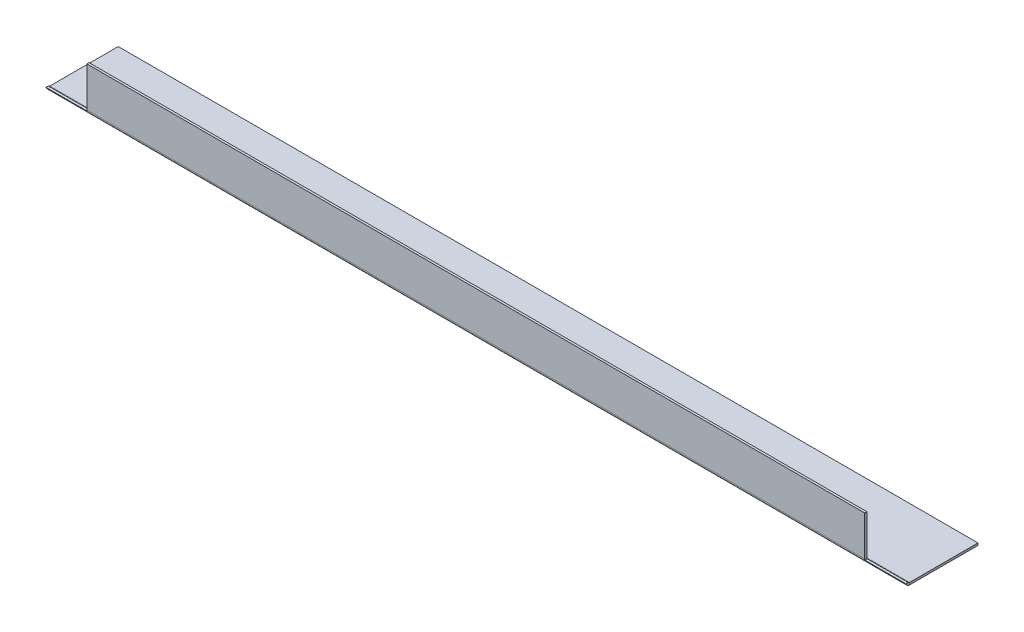
ISO-10303-21;
HEADER;
FILE_DESCRIPTION(('STEP AP214'),'2;1');
FILE_NAME('part.step','',(''),(''),'','','');
FILE_SCHEMA(('AUTOMOTIVE_DESIGN { 1 0 10303 214 1 1 1 1 }'));
ENDSEC;
DATA;
#1=APPLICATION_CONTEXT('core data for automotive mechanical design processes');
#2=APPLICATION_PROTOCOL_DEFINITION('international standard','automotive_design',2000,#1);
#3=PRODUCT_CONTEXT('',#1,'mechanical');
#4=PRODUCT('Part','Part','',(#3));
#5=PRODUCT_RELATED_PRODUCT_CATEGORY('part','',(#4));
#6=PRODUCT_DEFINITION_FORMATION('','',#4);
#7=PRODUCT_DEFINITION_CONTEXT('part definition',#1,'design');
#8=PRODUCT_DEFINITION('design','',#6,#7);
#9=PRODUCT_DEFINITION_SHAPE('','',#8);
#10=(LENGTH_UNIT() NAMED_UNIT(*) SI_UNIT(.MILLI.,.METRE.));
#11=(NAMED_UNIT(*) PLANE_ANGLE_UNIT() SI_UNIT($,.RADIAN.));
#12=(NAMED_UNIT(*) SI_UNIT($,.STERADIAN.) SOLID_ANGLE_UNIT());
#13=UNCERTAINTY_MEASURE_WITH_UNIT(LENGTH_MEASURE(1.E-05),#10,'distance_accuracy_value','');
#14=(GEOMETRIC_REPRESENTATION_CONTEXT(3) GLOBAL_UNCERTAINTY_ASSIGNED_CONTEXT((#13)) GLOBAL_UNIT_ASSIGNED_CONTEXT((#10,
#11,#12)) REPRESENTATION_CONTEXT('',''));
#15=CARTESIAN_POINT('',(0.,0.,0.));
#16=DIRECTION('',(0.,0.,1.));
#17=DIRECTION('',(1.,0.,0.));
#18=AXIS2_PLACEMENT_3D('',#15,#16,#17);
#19=CARTESIAN_POINT('',(0.,3.,93.5));
#20=DIRECTION('',(0.,-1.,0.));
#21=DIRECTION('',(1.,0.,0.));
#22=AXIS2_PLACEMENT_3D('',#19,#20,#21);
#23=PLANE('',#22);
#24=DIRECTION('',(-1.,0.,0.));
#25=VECTOR('',#24,1.);
#26=CARTESIAN_POINT('',(0.,3.,0.));
#27=LINE('',#26,#25);
#28=CARTESIAN_POINT('',(0.,3.,0.));
#29=VERTEX_POINT('',#28);
#30=CARTESIAN_POINT('',(-1176.,2.99999999999986,0.));
#31=VERTEX_POINT('',#30);
#32=EDGE_CURVE('E178',#29,#31,#27,.T.);
#33=ORIENTED_EDGE('',*,*,#32,.T.);
#34=DIRECTION('',(0.,0.,-1.));
#35=VECTOR('',#34,1.);
#36=CARTESIAN_POINT('',(-1176.,2.99999999999986,93.5));
#37=LINE('',#36,#35);
#38=CARTESIAN_POINT('',(-1176.,2.99999999999991,93.5));
#39=VERTEX_POINT('',#38);
#40=EDGE_CURVE('E211',#39,#31,#37,.T.);
#41=ORIENTED_EDGE('',*,*,#40,.F.);
#42=DIRECTION('',(-1.,0.,0.));
#43=VECTOR('',#42,1.);
#44=CARTESIAN_POINT('',(0.,3.,93.5));
#45=LINE('',#44,#43);
#46=CARTESIAN_POINT('',(0.,2.99999999999991,93.5));
#47=VERTEX_POINT('',#46);
#48=EDGE_CURVE('E183',#47,#39,#45,.T.);
#49=ORIENTED_EDGE('',*,*,#48,.F.);
#50=DIRECTION('',(0.,0.,-1.));
#51=VECTOR('',#50,1.);
#52=CARTESIAN_POINT('',(0.,3.,93.5));
#53=LINE('',#52,#51);
#54=EDGE_CURVE('E195',#47,#29,#53,.T.);
#55=ORIENTED_EDGE('',*,*,#54,.T.);
#56=EDGE_LOOP('',(#33,#41,#49,#55));
#57=FACE_BOUND('',#56,.T.);
#58=ADVANCED_FACE('F59',(#57),#23,.F.);
#59=CARTESIAN_POINT('',(-1176.,-1.44018463579729E-13,93.5));
#60=DIRECTION('',(-1.,0.,0.));
#61=DIRECTION('',(0.,0.,1.));
#62=AXIS2_PLACEMENT_3D('',#59,#60,#61);
#63=PLANE('',#62);
#64=DIRECTION('',(0.,1.,0.));
#65=VECTOR('',#64,1.);
#66=CARTESIAN_POINT('',(-1176.,-1.44018463579729E-13,0.));
#67=LINE('',#66,#65);
#68=CARTESIAN_POINT('',(-1176.,-1.44018463579729E-13,0.));
#69=VERTEX_POINT('',#68);
#70=EDGE_CURVE('E198',#69,#31,#67,.T.);
#71=ORIENTED_EDGE('',*,*,#70,.F.);
#72=DIRECTION('',(0.,0.,-1.));
#73=VECTOR('',#72,1.);
#74=CARTESIAN_POINT('',(-1176.,-1.44018463579729E-13,93.5));
#75=LINE('',#74,#73);
#76=CARTESIAN_POINT('',(-1176.,-1.44018463579729E-13,93.5));
#77=VERTEX_POINT('',#76);
#78=EDGE_CURVE('E209',#77,#69,#75,.T.);
#79=ORIENTED_EDGE('',*,*,#78,.F.);
#80=DIRECTION('',(0.,1.,0.));
#81=VECTOR('',#80,1.);
#82=CARTESIAN_POINT('',(-1176.,-1.44018463579729E-13,93.5));
#83=LINE('',#82,#81);
#84=EDGE_CURVE('E185',#77,#39,#83,.T.);
#85=ORIENTED_EDGE('',*,*,#84,.T.);
#86=ORIENTED_EDGE('',*,*,#40,.T.);
#87=EDGE_LOOP('',(#71,#79,#85,#86));
#88=FACE_BOUND('',#87,.T.);
#89=ADVANCED_FACE('F293',(#88),#63,.T.);
#90=CARTESIAN_POINT('',(0.,0.,93.5));
#91=DIRECTION('',(0.,-1.,0.));
#92=DIRECTION('',(1.,0.,0.));
#93=AXIS2_PLACEMENT_3D('',#90,#91,#92);
#94=PLANE('',#93);
#95=DIRECTION('',(-1.,0.,0.));
#96=VECTOR('',#95,1.);
#97=CARTESIAN_POINT('',(0.,0.,0.));
#98=LINE('',#97,#96);
#99=CARTESIAN_POINT('',(0.,0.,0.));
#100=VERTEX_POINT('',#99);
#101=EDGE_CURVE('E201',#100,#69,#98,.T.);
#102=ORIENTED_EDGE('',*,*,#101,.F.);
#103=DIRECTION('',(0.,0.,-1.));
#104=VECTOR('',#103,1.);
#105=CARTESIAN_POINT('',(0.,0.,93.5));
#106=LINE('',#105,#104);
#107=CARTESIAN_POINT('',(0.,0.,93.5));
#108=VERTEX_POINT('',#107);
#109=EDGE_CURVE('E207',#108,#100,#106,.T.);
#110=ORIENTED_EDGE('',*,*,#109,.F.);
#111=DIRECTION('',(-1.,0.,0.));
#112=VECTOR('',#111,1.);
#113=CARTESIAN_POINT('',(0.,0.,93.5));
#114=LINE('',#113,#112);
#115=EDGE_CURVE('E189',#108,#77,#114,.T.);
#116=ORIENTED_EDGE('',*,*,#115,.T.);
#117=ORIENTED_EDGE('',*,*,#78,.T.);
#118=EDGE_LOOP('',(#102,#110,#116,#117));
#119=FACE_BOUND('',#118,.T.);
#120=ADVANCED_FACE('F272',(#119),#94,.T.);
#121=CARTESIAN_POINT('',(0.,3.,93.5));
#122=DIRECTION('',(1.,0.,0.));
#123=DIRECTION('',(0.,1.,0.));
#124=AXIS2_PLACEMENT_3D('',#121,#122,#123);
#125=PLANE('',#124);
#126=DIRECTION('',(0.,-1.,0.));
#127=VECTOR('',#126,1.);
#128=CARTESIAN_POINT('',(0.,3.,0.));
#129=LINE('',#128,#127);
#130=EDGE_CURVE('E186',#29,#100,#129,.T.);
#131=ORIENTED_EDGE('',*,*,#130,.F.);
#132=ORIENTED_EDGE('',*,*,#54,.F.);
#133=DIRECTION('',(0.,-1.,0.));
#134=VECTOR('',#133,1.);
#135=CARTESIAN_POINT('',(0.,3.,93.5));
#136=LINE('',#135,#134);
#137=EDGE_CURVE('E192',#47,#108,#136,.T.);
#138=ORIENTED_EDGE('',*,*,#137,.T.);
#139=ORIENTED_EDGE('',*,*,#109,.T.);
#140=EDGE_LOOP('',(#131,#132,#138,#139));
#141=FACE_BOUND('',#140,.T.);
#142=ADVANCED_FACE('F276',(#141),#125,.T.);
#143=CARTESIAN_POINT('',(0.,0.,0.));
#144=DIRECTION('',(0.,0.,-1.));
#145=DIRECTION('',(-1.,0.,0.));
#146=AXIS2_PLACEMENT_3D('',#143,#144,#145);
#147=PLANE('',#146);
#148=ORIENTED_EDGE('',*,*,#32,.F.);
#149=ORIENTED_EDGE('',*,*,#130,.T.);
#150=ORIENTED_EDGE('',*,*,#101,.T.);
#151=ORIENTED_EDGE('',*,*,#70,.T.);
#152=EDGE_LOOP('',(#148,#149,#150,#151));
#153=FACE_BOUND('',#152,.T.);
#154=ADVANCED_FACE('F306',(#153),#147,.T.);
#155=CARTESIAN_POINT('',(-1176.,5.49999999999989,93.5));
#156=DIRECTION('',(-1.,0.,0.));
#157=DIRECTION('',(0.,0.,1.));
#158=AXIS2_PLACEMENT_3D('',#155,#156,#157);
#159=PLANE('',#158);
#160=DIRECTION('',(0.,0.,1.));
#161=VECTOR('',#160,1.);
#162=CARTESIAN_POINT('',(-1176.,4.00000000000001,89.));
#163=LINE('',#162,#161);
#164=CARTESIAN_POINT('',(-1176.,4.00000000000001,95.5000000000001));
#165=VERTEX_POINT('',#164);
#166=CARTESIAN_POINT('',(-1176.,4.00000000000001,98.7915026221292));
#167=VERTEX_POINT('',#166);
#168=EDGE_CURVE('E226',#165,#167,#163,.T.);
#169=ORIENTED_EDGE('',*,*,#168,.F.);
#170=CARTESIAN_POINT('',(-1176.,5.49999999999989,93.5));
#171=DIRECTION('',(1.,0.,0.));
#172=DIRECTION('',(0.,0.,-1.));
#173=AXIS2_PLACEMENT_3D('',#170,#171,#172);
#174=CIRCLE('',#173,2.49999999999999);
#175=EDGE_CURVE('E164',#39,#165,#174,.F.);
#176=ORIENTED_EDGE('',*,*,#175,.F.);
#177=ORIENTED_EDGE('',*,*,#84,.F.);
#178=CARTESIAN_POINT('',(-1176.,5.49999999999989,93.5));
#179=DIRECTION('',(1.,0.,0.));
#180=DIRECTION('',(0.,0.,-1.));
#181=AXIS2_PLACEMENT_3D('',#178,#179,#180);
#182=CIRCLE('',#181,5.49999999999999);
#183=EDGE_CURVE('E175',#77,#167,#182,.F.);
#184=ORIENTED_EDGE('',*,*,#183,.T.);
#185=EDGE_LOOP('',(#169,#176,#177,#184));
#186=FACE_BOUND('',#185,.T.);
#187=ADVANCED_FACE('F231',(#186),#159,.T.);
#188=CARTESIAN_POINT('',(0.,5.49999999999989,93.5));
#189=DIRECTION('',(-1.,0.,0.));
#190=DIRECTION('',(0.,0.,1.));
#191=AXIS2_PLACEMENT_3D('',#188,#189,#190);
#192=PLANE('',#191);
#193=DIRECTION('',(0.,0.,1.));
#194=VECTOR('',#193,1.);
#195=CARTESIAN_POINT('',(0.,4.,89.));
#196=LINE('',#195,#194);
#197=CARTESIAN_POINT('',(0.,4.,95.5000000000001));
#198=VERTEX_POINT('',#197);
#199=CARTESIAN_POINT('',(0.,4.,98.7915026221292));
#200=VERTEX_POINT('',#199);
#201=EDGE_CURVE('E260',#198,#200,#196,.T.);
#202=ORIENTED_EDGE('',*,*,#201,.T.);
#203=CARTESIAN_POINT('',(0.,5.49999999999989,93.5));
#204=DIRECTION('',(1.,0.,0.));
#205=DIRECTION('',(0.,0.,-1.));
#206=AXIS2_PLACEMENT_3D('',#203,#204,#205);
#207=CIRCLE('',#206,5.49999999999999);
#208=EDGE_CURVE('E179',#200,#108,#207,.T.);
#209=ORIENTED_EDGE('',*,*,#208,.T.);
#210=ORIENTED_EDGE('',*,*,#137,.F.);
#211=CARTESIAN_POINT('',(0.,5.49999999999989,93.5));
#212=DIRECTION('',(1.,0.,0.));
#213=DIRECTION('',(0.,0.,-1.));
#214=AXIS2_PLACEMENT_3D('',#211,#212,#213);
#215=CIRCLE('',#214,2.49999999999999);
#216=EDGE_CURVE('E161',#198,#47,#215,.T.);
#217=ORIENTED_EDGE('',*,*,#216,.F.);
#218=EDGE_LOOP('',(#202,#209,#210,#217));
#219=FACE_BOUND('',#218,.T.);
#220=ADVANCED_FACE('F265',(#219),#192,.F.);
#221=CARTESIAN_POINT('',(0.,5.49999999999989,93.5));
#222=DIRECTION('',(1.,0.,0.));
#223=DIRECTION('',(0.,0.,1.));
#224=AXIS2_PLACEMENT_3D('',#221,#222,#223);
#225=CYLINDRICAL_SURFACE('',#224,5.49999999999999);
#226=DIRECTION('',(1.,0.,0.));
#227=VECTOR('',#226,1.);
#228=CARTESIAN_POINT('',(0.,4.,98.7915026221292));
#229=LINE('',#228,#227);
#230=CARTESIAN_POINT('',(-56.,4.,98.7915026221292));
#231=VERTEX_POINT('',#230);
#232=EDGE_CURVE('E238',#231,#200,#229,.T.);
#233=ORIENTED_EDGE('',*,*,#232,.F.);
#234=CARTESIAN_POINT('',(-56.,5.49999999999989,93.5));
#235=DIRECTION('',(-1.,0.,0.));
#236=DIRECTION('',(0.,0.,1.));
#237=AXIS2_PLACEMENT_3D('',#234,#235,#236);
#238=CIRCLE('',#237,5.49999999999999);
#239=CARTESIAN_POINT('',(-56.,5.49999999999985,99.));
#240=VERTEX_POINT('',#239);
#241=EDGE_CURVE('E250',#240,#231,#238,.F.);
#242=ORIENTED_EDGE('',*,*,#241,.F.);
#243=DIRECTION('',(1.,0.,0.));
#244=VECTOR('',#243,1.);
#245=CARTESIAN_POINT('',(-1176.,5.49999999999984,99.));
#246=LINE('',#245,#244);
#247=CARTESIAN_POINT('',(-1120.,5.49999999999984,99.));
#248=VERTEX_POINT('',#247);
#249=EDGE_CURVE('E154',#240,#248,#246,.F.);
#250=ORIENTED_EDGE('',*,*,#249,.T.);
#251=CARTESIAN_POINT('',(-1120.,5.49999999999989,93.5));
#252=DIRECTION('',(1.,0.,0.));
#253=DIRECTION('',(0.,0.,-1.));
#254=AXIS2_PLACEMENT_3D('',#251,#252,#253);
#255=CIRCLE('',#254,5.49999999999999);
#256=CARTESIAN_POINT('',(-1120.,4.00000000000001,98.7915026221292));
#257=VERTEX_POINT('',#256);
#258=EDGE_CURVE('E242',#257,#248,#255,.F.);
#259=ORIENTED_EDGE('',*,*,#258,.F.);
#260=DIRECTION('',(1.,0.,0.));
#261=VECTOR('',#260,1.);
#262=CARTESIAN_POINT('',(0.,4.00000000000001,98.7915026221292));
#263=LINE('',#262,#261);
#264=EDGE_CURVE('E168',#167,#257,#263,.T.);
#265=ORIENTED_EDGE('',*,*,#264,.F.);
#266=ORIENTED_EDGE('',*,*,#183,.F.);
#267=ORIENTED_EDGE('',*,*,#115,.F.);
#268=ORIENTED_EDGE('',*,*,#208,.F.);
#269=EDGE_LOOP('',(#233,#242,#250,#259,#265,#266,#267,#268));
#270=FACE_BOUND('',#269,.T.);
#271=ADVANCED_FACE('F249',(#270),#225,.T.);
#272=CARTESIAN_POINT('',(0.,5.49999999999989,93.5));
#273=DIRECTION('',(1.,0.,0.));
#274=DIRECTION('',(0.,0.,1.));
#275=AXIS2_PLACEMENT_3D('',#272,#273,#274);
#276=CYLINDRICAL_SURFACE('',#275,2.49999999999999);
#277=CARTESIAN_POINT('',(-56.,5.49999999999989,93.5));
#278=DIRECTION('',(-1.,0.,0.));
#279=DIRECTION('',(0.,0.,1.));
#280=AXIS2_PLACEMENT_3D('',#277,#278,#279);
#281=CIRCLE('',#280,2.49999999999999);
#282=CARTESIAN_POINT('',(-56.,5.49999999999984,96.));
#283=VERTEX_POINT('',#282);
#284=CARTESIAN_POINT('',(-56.,4.,95.5000000000001));
#285=VERTEX_POINT('',#284);
#286=EDGE_CURVE('E254',#283,#285,#281,.F.);
#287=ORIENTED_EDGE('',*,*,#286,.T.);
#288=DIRECTION('',(1.,0.,0.));
#289=VECTOR('',#288,1.);
#290=CARTESIAN_POINT('',(0.,4.,95.5000000000001));
#291=LINE('',#290,#289);
#292=EDGE_CURVE('E13',#285,#198,#291,.T.);
#293=ORIENTED_EDGE('',*,*,#292,.T.);
#294=ORIENTED_EDGE('',*,*,#216,.T.);
#295=ORIENTED_EDGE('',*,*,#48,.T.);
#296=ORIENTED_EDGE('',*,*,#175,.T.);
#297=DIRECTION('',(1.,0.,0.));
#298=VECTOR('',#297,1.);
#299=CARTESIAN_POINT('',(0.,4.00000000000001,95.5000000000001));
#300=LINE('',#299,#298);
#301=CARTESIAN_POINT('',(-1120.,4.00000000000001,95.5000000000001));
#302=VERTEX_POINT('',#301);
#303=EDGE_CURVE('E151',#165,#302,#300,.T.);
#304=ORIENTED_EDGE('',*,*,#303,.T.);
#305=CARTESIAN_POINT('',(-1120.,5.49999999999989,93.5));
#306=DIRECTION('',(1.,0.,0.));
#307=DIRECTION('',(0.,0.,-1.));
#308=AXIS2_PLACEMENT_3D('',#305,#306,#307);
#309=CIRCLE('',#308,2.49999999999999);
#310=CARTESIAN_POINT('',(-1120.,5.49999999999984,96.));
#311=VERTEX_POINT('',#310);
#312=EDGE_CURVE('E219',#302,#311,#309,.F.);
#313=ORIENTED_EDGE('',*,*,#312,.T.);
#314=DIRECTION('',(1.,0.,0.));
#315=VECTOR('',#314,1.);
#316=CARTESIAN_POINT('',(-1176.,5.49999999999984,96.));
#317=LINE('',#316,#315);
#318=EDGE_CURVE('E172',#311,#283,#317,.T.);
#319=ORIENTED_EDGE('',*,*,#318,.T.);
#320=EDGE_LOOP('',(#287,#293,#294,#295,#296,#304,#313,#319));
#321=FACE_BOUND('',#320,.T.);
#322=ADVANCED_FACE('F218',(#321),#276,.F.);
#323=CARTESIAN_POINT('',(0.,0.,99.));
#324=DIRECTION('',(0.,0.,-1.));
#325=DIRECTION('',(-1.,0.,0.));
#326=AXIS2_PLACEMENT_3D('',#323,#324,#325);
#327=PLANE('',#326);
#328=ORIENTED_EDGE('',*,*,#249,.F.);
#329=DIRECTION('',(0.,-1.,0.));
#330=VECTOR('',#329,1.);
#331=CARTESIAN_POINT('',(-56.,60.,99.));
#332=LINE('',#331,#330);
#333=CARTESIAN_POINT('',(-56.,60.,99.));
#334=VERTEX_POINT('',#333);
#335=EDGE_CURVE('E147',#334,#240,#332,.T.);
#336=ORIENTED_EDGE('',*,*,#335,.F.);
#337=DIRECTION('',(-1.,0.,0.));
#338=VECTOR('',#337,1.);
#339=CARTESIAN_POINT('',(0.,60.,99.));
#340=LINE('',#339,#338);
#341=CARTESIAN_POINT('',(-1120.,60.,99.));
#342=VERTEX_POINT('',#341);
#343=EDGE_CURVE('E81',#334,#342,#340,.T.);
#344=ORIENTED_EDGE('',*,*,#343,.T.);
#345=DIRECTION('',(0.,1.,0.));
#346=VECTOR('',#345,1.);
#347=CARTESIAN_POINT('',(-1120.,60.,99.));
#348=LINE('',#347,#346);
#349=EDGE_CURVE('E234',#248,#342,#348,.T.);
#350=ORIENTED_EDGE('',*,*,#349,.F.);
#351=EDGE_LOOP('',(#328,#336,#344,#350));
#352=FACE_BOUND('',#351,.T.);
#353=ADVANCED_FACE('F153',(#352),#327,.F.);
#354=CARTESIAN_POINT('',(0.,0.,96.));
#355=DIRECTION('',(0.,0.,-1.));
#356=DIRECTION('',(-1.,0.,0.));
#357=AXIS2_PLACEMENT_3D('',#354,#355,#356);
#358=PLANE('',#357);
#359=DIRECTION('',(0.,1.,0.));
#360=VECTOR('',#359,1.);
#361=CARTESIAN_POINT('',(-56.,0.,96.));
#362=LINE('',#361,#360);
#363=CARTESIAN_POINT('',(-56.,60.,96.));
#364=VERTEX_POINT('',#363);
#365=EDGE_CURVE('E73',#283,#364,#362,.T.);
#366=ORIENTED_EDGE('',*,*,#365,.F.);
#367=ORIENTED_EDGE('',*,*,#318,.F.);
#368=DIRECTION('',(0.,-1.,0.));
#369=VECTOR('',#368,1.);
#370=CARTESIAN_POINT('',(-1120.,0.,96.));
#371=LINE('',#370,#369);
#372=CARTESIAN_POINT('',(-1120.,60.,96.));
#373=VERTEX_POINT('',#372);
#374=EDGE_CURVE('E236',#373,#311,#371,.T.);
#375=ORIENTED_EDGE('',*,*,#374,.F.);
#376=DIRECTION('',(1.,0.,0.));
#377=VECTOR('',#376,1.);
#378=CARTESIAN_POINT('',(-1176.,60.,96.));
#379=LINE('',#378,#377);
#380=EDGE_CURVE('E162',#364,#373,#379,.F.);
#381=ORIENTED_EDGE('',*,*,#380,.F.);
#382=EDGE_LOOP('',(#366,#367,#375,#381));
#383=FACE_BOUND('',#382,.T.);
#384=ADVANCED_FACE('F282',(#383),#358,.T.);
#385=CARTESIAN_POINT('',(-1176.,60.,99.));
#386=DIRECTION('',(0.,-1.,0.));
#387=DIRECTION('',(0.,0.,-1.));
#388=AXIS2_PLACEMENT_3D('',#385,#386,#387);
#389=PLANE('',#388);
#390=ORIENTED_EDGE('',*,*,#343,.F.);
#391=DIRECTION('',(0.,0.,-1.));
#392=VECTOR('',#391,1.);
#393=CARTESIAN_POINT('',(-56.,60.,99.));
#394=LINE('',#393,#392);
#395=EDGE_CURVE('E66',#334,#364,#394,.T.);
#396=ORIENTED_EDGE('',*,*,#395,.T.);
#397=ORIENTED_EDGE('',*,*,#380,.T.);
#398=DIRECTION('',(0.,0.,1.));
#399=VECTOR('',#398,1.);
#400=CARTESIAN_POINT('',(-1120.,60.,99.));
#401=LINE('',#400,#399);
#402=EDGE_CURVE('E160',#373,#342,#401,.T.);
#403=ORIENTED_EDGE('',*,*,#402,.T.);
#404=EDGE_LOOP('',(#390,#396,#397,#403));
#405=FACE_BOUND('',#404,.T.);
#406=ADVANCED_FACE('F158',(#405),#389,.F.);
#407=CARTESIAN_POINT('',(-1176.,4.00000000000001,89.));
#408=DIRECTION('',(0.,-1.,0.));
#409=DIRECTION('',(0.,0.,-1.));
#410=AXIS2_PLACEMENT_3D('',#407,#408,#409);
#411=PLANE('',#410);
#412=ORIENTED_EDGE('',*,*,#264,.T.);
#413=DIRECTION('',(0.,0.,1.));
#414=VECTOR('',#413,1.);
#415=CARTESIAN_POINT('',(-1120.,4.00000000000001,89.));
#416=LINE('',#415,#414);
#417=EDGE_CURVE('E229',#302,#257,#416,.T.);
#418=ORIENTED_EDGE('',*,*,#417,.F.);
#419=ORIENTED_EDGE('',*,*,#303,.F.);
#420=ORIENTED_EDGE('',*,*,#168,.T.);
#421=EDGE_LOOP('',(#412,#418,#419,#420));
#422=FACE_BOUND('',#421,.T.);
#423=ADVANCED_FACE('F225',(#422),#411,.F.);
#424=CARTESIAN_POINT('',(-1120.,60.,89.));
#425=DIRECTION('',(1.,0.,0.));
#426=DIRECTION('',(0.,0.,-1.));
#427=AXIS2_PLACEMENT_3D('',#424,#425,#426);
#428=PLANE('',#427);
#429=ORIENTED_EDGE('',*,*,#258,.T.);
#430=ORIENTED_EDGE('',*,*,#349,.T.);
#431=ORIENTED_EDGE('',*,*,#402,.F.);
#432=ORIENTED_EDGE('',*,*,#374,.T.);
#433=ORIENTED_EDGE('',*,*,#312,.F.);
#434=ORIENTED_EDGE('',*,*,#417,.T.);
#435=EDGE_LOOP('',(#429,#430,#431,#432,#433,#434));
#436=FACE_BOUND('',#435,.T.);
#437=ADVANCED_FACE('F247',(#436),#428,.F.);
#438=CARTESIAN_POINT('',(0.,4.,89.));
#439=DIRECTION('',(0.,-1.,0.));
#440=DIRECTION('',(1.,0.,0.));
#441=AXIS2_PLACEMENT_3D('',#438,#439,#440);
#442=PLANE('',#441);
#443=ORIENTED_EDGE('',*,*,#232,.T.);
#444=ORIENTED_EDGE('',*,*,#201,.F.);
#445=ORIENTED_EDGE('',*,*,#292,.F.);
#446=DIRECTION('',(0.,0.,1.));
#447=VECTOR('',#446,1.);
#448=CARTESIAN_POINT('',(-56.,4.,89.));
#449=LINE('',#448,#447);
#450=EDGE_CURVE('E155',#285,#231,#449,.T.);
#451=ORIENTED_EDGE('',*,*,#450,.T.);
#452=EDGE_LOOP('',(#443,#444,#445,#451));
#453=FACE_BOUND('',#452,.T.);
#454=ADVANCED_FACE('F280',(#453),#442,.F.);
#455=CARTESIAN_POINT('',(-56.,60.,89.));
#456=DIRECTION('',(-1.,0.,0.));
#457=DIRECTION('',(0.,0.,1.));
#458=AXIS2_PLACEMENT_3D('',#455,#456,#457);
#459=PLANE('',#458);
#460=ORIENTED_EDGE('',*,*,#241,.T.);
#461=ORIENTED_EDGE('',*,*,#450,.F.);
#462=ORIENTED_EDGE('',*,*,#286,.F.);
#463=ORIENTED_EDGE('',*,*,#365,.T.);
#464=ORIENTED_EDGE('',*,*,#395,.F.);
#465=ORIENTED_EDGE('',*,*,#335,.T.);
#466=EDGE_LOOP('',(#460,#461,#462,#463,#464,#465));
#467=FACE_BOUND('',#466,.T.);
#468=ADVANCED_FACE('F146',(#467),#459,.F.);
#469=CLOSED_SHELL('',(#58,#89,#120,#142,#154,#187,#220,#271,#322,#353,#384,#406,#423,#437,#454,#468));
#470=MANIFOLD_SOLID_BREP('B2',#469);
#471=ADVANCED_BREP_SHAPE_REPRESENTATION('',(#18,#470),#14);
#472=SHAPE_DEFINITION_REPRESENTATION(#9,#471);
ENDSEC;
END-ISO-10303-21;
